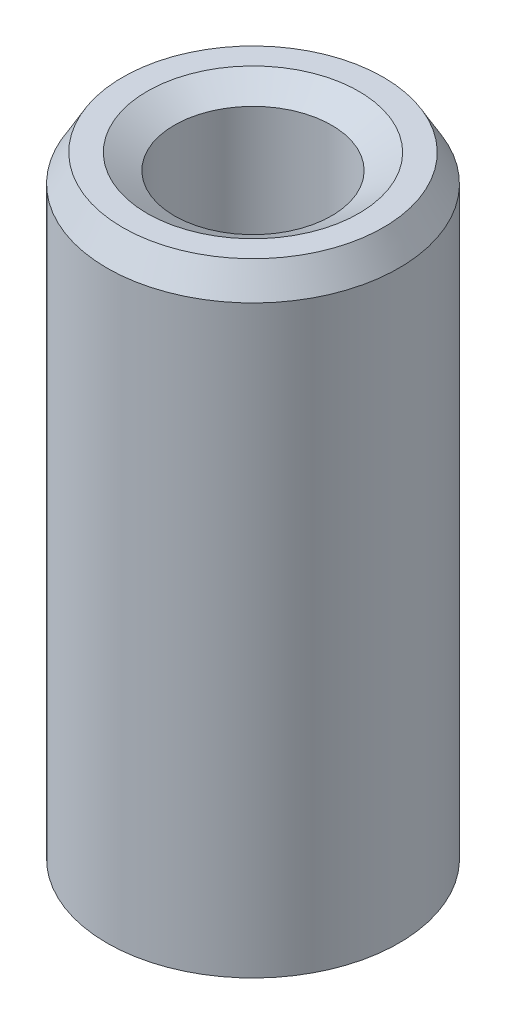
ISO-10303-21;
HEADER;
FILE_DESCRIPTION(('STEP AP214'),'2;1');
FILE_NAME('part.step','',(''),(''),'','','');
FILE_SCHEMA(('AUTOMOTIVE_DESIGN { 1 0 10303 214 1 1 1 1 }'));
ENDSEC;
DATA;
#1=APPLICATION_CONTEXT('core data for automotive mechanical design processes');
#2=APPLICATION_PROTOCOL_DEFINITION('international standard','automotive_design',2000,#1);
#3=PRODUCT_CONTEXT('',#1,'mechanical');
#4=PRODUCT('Part','Part','',(#3));
#5=PRODUCT_RELATED_PRODUCT_CATEGORY('part','',(#4));
#6=PRODUCT_DEFINITION_FORMATION('','',#4);
#7=PRODUCT_DEFINITION_CONTEXT('part definition',#1,'design');
#8=PRODUCT_DEFINITION('design','',#6,#7);
#9=PRODUCT_DEFINITION_SHAPE('','',#8);
#10=(LENGTH_UNIT() NAMED_UNIT(*) SI_UNIT(.MILLI.,.METRE.));
#11=(NAMED_UNIT(*) PLANE_ANGLE_UNIT() SI_UNIT($,.RADIAN.));
#12=(NAMED_UNIT(*) SI_UNIT($,.STERADIAN.) SOLID_ANGLE_UNIT());
#13=UNCERTAINTY_MEASURE_WITH_UNIT(LENGTH_MEASURE(1.E-05),#10,'distance_accuracy_value','');
#14=(GEOMETRIC_REPRESENTATION_CONTEXT(3) GLOBAL_UNCERTAINTY_ASSIGNED_CONTEXT((#13)) GLOBAL_UNIT_ASSIGNED_CONTEXT((#10,
#11,#12)) REPRESENTATION_CONTEXT('',''));
#15=CARTESIAN_POINT('',(0.,0.,0.));
#16=DIRECTION('',(0.,0.,1.));
#17=DIRECTION('',(1.,0.,0.));
#18=AXIS2_PLACEMENT_3D('',#15,#16,#17);
#19=CARTESIAN_POINT('',(0.,21.4898547928106,0.));
#20=DIRECTION('',(0.,-1.,0.));
#21=DIRECTION('',(0.,0.,-1.));
#22=AXIS2_PLACEMENT_3D('',#19,#20,#21);
#23=CYLINDRICAL_SURFACE('',#22,5.);
#24=CARTESIAN_POINT('',(0.,0.538203605921137,0.));
#25=DIRECTION('',(0.,1.,0.));
#26=DIRECTION('',(0.,0.,1.));
#27=AXIS2_PLACEMENT_3D('',#24,#25,#26);
#28=CIRCLE('',#27,5.);
#29=CARTESIAN_POINT('',(0.,0.538203605921137,5.));
#30=VERTEX_POINT('',#29);
#31=EDGE_CURVE('E10',#30,#30,#28,.T.);
#32=ORIENTED_EDGE('',*,*,#31,.T.);
#33=EDGE_LOOP('',(#32));
#34=FACE_BOUND('',#33,.T.);
#35=CARTESIAN_POINT('',(0.,20.5576588025384,0.));
#36=DIRECTION('',(0.,1.,0.));
#37=DIRECTION('',(0.,0.,1.));
#38=AXIS2_PLACEMENT_3D('',#35,#36,#37);
#39=CIRCLE('',#38,5.);
#40=CARTESIAN_POINT('',(0.,20.5576588025384,5.));
#41=VERTEX_POINT('',#40);
#42=EDGE_CURVE('E50',#41,#41,#39,.F.);
#43=ORIENTED_EDGE('',*,*,#42,.T.);
#44=EDGE_LOOP('',(#43));
#45=FACE_BOUND('',#44,.T.);
#46=ADVANCED_FACE('F39',(#34,#45),#23,.T.);
#47=CARTESIAN_POINT('',(0.,21.4898547928106,0.));
#48=DIRECTION('',(0.,1.,0.));
#49=DIRECTION('',(0.,0.,1.));
#50=AXIS2_PLACEMENT_3D('',#47,#48,#49);
#51=PLANE('',#50);
#52=CARTESIAN_POINT('',(0.,21.4898547928106,0.));
#53=DIRECTION('',(0.,1.,0.));
#54=DIRECTION('',(0.,0.,1.));
#55=AXIS2_PLACEMENT_3D('',#52,#53,#54);
#56=CIRCLE('',#55,3.62444905721905);
#57=CARTESIAN_POINT('',(0.,21.4898547928106,3.62444905721905));
#58=VERTEX_POINT('',#57);
#59=EDGE_CURVE('E58',#58,#58,#56,.F.);
#60=ORIENTED_EDGE('',*,*,#59,.T.);
#61=EDGE_LOOP('',(#60));
#62=FACE_BOUND('',#61,.T.);
#63=CARTESIAN_POINT('',(0.,21.4898547928106,0.));
#64=DIRECTION('',(0.,1.,0.));
#65=DIRECTION('',(0.,0.,1.));
#66=AXIS2_PLACEMENT_3D('',#63,#64,#65);
#67=CIRCLE('',#66,4.46179639407887);
#68=CARTESIAN_POINT('',(0.,21.4898547928106,4.46179639407887));
#69=VERTEX_POINT('',#68);
#70=EDGE_CURVE('E61',#69,#69,#67,.T.);
#71=ORIENTED_EDGE('',*,*,#70,.T.);
#72=EDGE_LOOP('',(#71));
#73=FACE_BOUND('',#72,.T.);
#74=ADVANCED_FACE('F88',(#62,#73),#51,.T.);
#75=CARTESIAN_POINT('',(0.,0.,0.));
#76=DIRECTION('',(0.,1.,0.));
#77=DIRECTION('',(0.,0.,1.));
#78=AXIS2_PLACEMENT_3D('',#75,#76,#77);
#79=PLANE('',#78);
#80=CARTESIAN_POINT('',(0.,0.,0.));
#81=DIRECTION('',(0.,1.,0.));
#82=DIRECTION('',(0.,0.,1.));
#83=AXIS2_PLACEMENT_3D('',#80,#81,#82);
#84=CIRCLE('',#83,3.23045667286799);
#85=CARTESIAN_POINT('',(0.,0.,3.23045667286799));
#86=VERTEX_POINT('',#85);
#87=EDGE_CURVE('E51',#86,#86,#84,.T.);
#88=ORIENTED_EDGE('',*,*,#87,.T.);
#89=EDGE_LOOP('',(#88));
#90=FACE_BOUND('',#89,.T.);
#91=CARTESIAN_POINT('',(0.,0.,0.));
#92=DIRECTION('',(0.,1.,0.));
#93=DIRECTION('',(0.,0.,1.));
#94=AXIS2_PLACEMENT_3D('',#91,#92,#93);
#95=CIRCLE('',#94,4.06780400972781);
#96=CARTESIAN_POINT('',(0.,0.,4.06780400972781));
#97=VERTEX_POINT('',#96);
#98=EDGE_CURVE('E54',#97,#97,#95,.F.);
#99=ORIENTED_EDGE('',*,*,#98,.T.);
#100=EDGE_LOOP('',(#99));
#101=FACE_BOUND('',#100,.T.);
#102=ADVANCED_FACE('F83',(#90,#101),#79,.F.);
#103=CARTESIAN_POINT('',(0.,21.4898547928106,0.));
#104=DIRECTION('',(0.,-1.,0.));
#105=DIRECTION('',(0.,0.,-1.));
#106=AXIS2_PLACEMENT_3D('',#103,#104,#105);
#107=CYLINDRICAL_SURFACE('',#106,2.69225306694686);
#108=CARTESIAN_POINT('',(0.,20.9516511868894,0.));
#109=DIRECTION('',(0.,1.,0.));
#110=DIRECTION('',(0.,0.,1.));
#111=AXIS2_PLACEMENT_3D('',#108,#109,#110);
#112=CIRCLE('',#111,2.69225306694686);
#113=CARTESIAN_POINT('',(0.,20.9516511868894,2.69225306694686));
#114=VERTEX_POINT('',#113);
#115=EDGE_CURVE('E67',#114,#114,#112,.T.);
#116=ORIENTED_EDGE('',*,*,#115,.T.);
#117=EDGE_LOOP('',(#116));
#118=FACE_BOUND('',#117,.T.);
#119=CARTESIAN_POINT('',(0.,0.932195990272194,0.));
#120=DIRECTION('',(0.,1.,0.));
#121=DIRECTION('',(0.,0.,1.));
#122=AXIS2_PLACEMENT_3D('',#119,#120,#121);
#123=CIRCLE('',#122,2.69225306694686);
#124=CARTESIAN_POINT('',(0.,0.932195990272194,2.69225306694686));
#125=VERTEX_POINT('',#124);
#126=EDGE_CURVE('E69',#125,#125,#123,.F.);
#127=ORIENTED_EDGE('',*,*,#126,.T.);
#128=EDGE_LOOP('',(#127));
#129=FACE_BOUND('',#128,.T.);
#130=ADVANCED_FACE('F71',(#118,#129),#107,.F.);
#131=CARTESIAN_POINT('',(0.,20.9516511868894,0.));
#132=DIRECTION('',(0.,1.,0.));
#133=DIRECTION('',(0.,0.,1.));
#134=AXIS2_PLACEMENT_3D('',#131,#132,#133);
#135=CONICAL_SURFACE('',#134,2.69225306694686,1.0471975511966);
#136=ORIENTED_EDGE('',*,*,#59,.F.);
#137=EDGE_LOOP('',(#136));
#138=FACE_BOUND('',#137,.T.);
#139=ORIENTED_EDGE('',*,*,#115,.F.);
#140=EDGE_LOOP('',(#139));
#141=FACE_BOUND('',#140,.T.);
#142=ADVANCED_FACE('F77',(#138,#141),#135,.F.);
#143=CARTESIAN_POINT('',(0.,0.,0.));
#144=DIRECTION('',(0.,-1.,0.));
#145=DIRECTION('',(0.,0.,-1.));
#146=AXIS2_PLACEMENT_3D('',#143,#144,#145);
#147=CONICAL_SURFACE('',#146,3.23045667286799,0.523598775598295);
#148=ORIENTED_EDGE('',*,*,#126,.F.);
#149=EDGE_LOOP('',(#148));
#150=FACE_BOUND('',#149,.T.);
#151=ORIENTED_EDGE('',*,*,#87,.F.);
#152=EDGE_LOOP('',(#151));
#153=FACE_BOUND('',#152,.T.);
#154=ADVANCED_FACE('F73',(#150,#153),#147,.F.);
#155=CARTESIAN_POINT('',(0.,0.538203605921137,0.));
#156=DIRECTION('',(0.,1.,0.));
#157=DIRECTION('',(0.,0.,1.));
#158=AXIS2_PLACEMENT_3D('',#155,#156,#157);
#159=CONICAL_SURFACE('',#158,5.,1.0471975511966);
#160=ORIENTED_EDGE('',*,*,#98,.F.);
#161=EDGE_LOOP('',(#160));
#162=FACE_BOUND('',#161,.T.);
#163=ORIENTED_EDGE('',*,*,#31,.F.);
#164=EDGE_LOOP('',(#163));
#165=FACE_BOUND('',#164,.T.);
#166=ADVANCED_FACE('F76',(#162,#165),#159,.T.);
#167=CARTESIAN_POINT('',(0.,21.4898547928106,0.));
#168=DIRECTION('',(0.,-1.,0.));
#169=DIRECTION('',(0.,0.,-1.));
#170=AXIS2_PLACEMENT_3D('',#167,#168,#169);
#171=CONICAL_SURFACE('',#170,4.46179639407887,0.523598775598294);
#172=ORIENTED_EDGE('',*,*,#42,.F.);
#173=EDGE_LOOP('',(#172));
#174=FACE_BOUND('',#173,.T.);
#175=ORIENTED_EDGE('',*,*,#70,.F.);
#176=EDGE_LOOP('',(#175));
#177=FACE_BOUND('',#176,.T.);
#178=ADVANCED_FACE('F45',(#174,#177),#171,.T.);
#179=CLOSED_SHELL('',(#46,#74,#102,#130,#142,#154,#166,#178));
#180=MANIFOLD_SOLID_BREP('B2',#179);
#181=ADVANCED_BREP_SHAPE_REPRESENTATION('',(#18,#180),#14);
#182=SHAPE_DEFINITION_REPRESENTATION(#9,#181);
ENDSEC;
END-ISO-10303-21;
